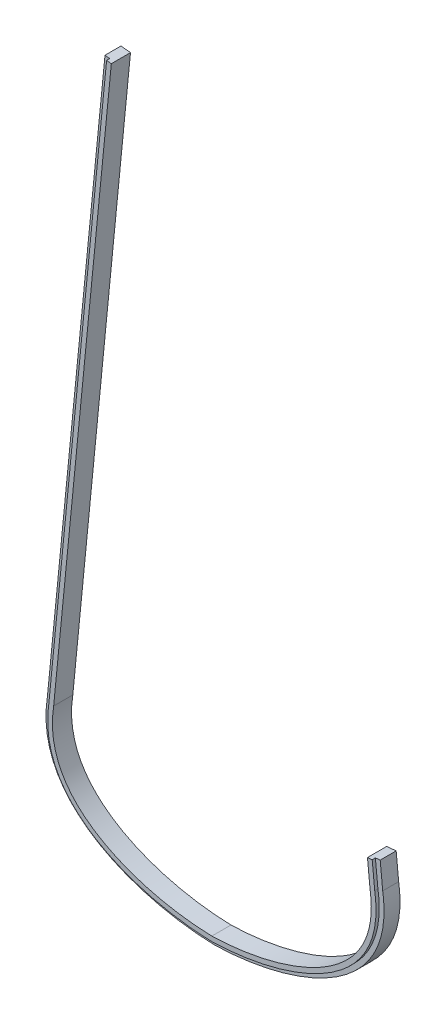
ISO-10303-21;
HEADER;
FILE_DESCRIPTION(('STEP AP214'),'2;1');
FILE_NAME('part.step','',(''),(''),'','','');
FILE_SCHEMA(('AUTOMOTIVE_DESIGN { 1 0 10303 214 1 1 1 1 }'));
ENDSEC;
DATA;
#1=APPLICATION_CONTEXT('core data for automotive mechanical design processes');
#2=APPLICATION_PROTOCOL_DEFINITION('international standard','automotive_design',2000,#1);
#3=PRODUCT_CONTEXT('',#1,'mechanical');
#4=PRODUCT('Part','Part','',(#3));
#5=PRODUCT_RELATED_PRODUCT_CATEGORY('part','',(#4));
#6=PRODUCT_DEFINITION_FORMATION('','',#4);
#7=PRODUCT_DEFINITION_CONTEXT('part definition',#1,'design');
#8=PRODUCT_DEFINITION('design','',#6,#7);
#9=PRODUCT_DEFINITION_SHAPE('','',#8);
#10=(LENGTH_UNIT() NAMED_UNIT(*) SI_UNIT(.MILLI.,.METRE.));
#11=(NAMED_UNIT(*) PLANE_ANGLE_UNIT() SI_UNIT($,.RADIAN.));
#12=(NAMED_UNIT(*) SI_UNIT($,.STERADIAN.) SOLID_ANGLE_UNIT());
#13=UNCERTAINTY_MEASURE_WITH_UNIT(LENGTH_MEASURE(1.E-05),#10,'distance_accuracy_value','');
#14=(GEOMETRIC_REPRESENTATION_CONTEXT(3) GLOBAL_UNCERTAINTY_ASSIGNED_CONTEXT((#13)) GLOBAL_UNIT_ASSIGNED_CONTEXT((#10,
#11,#12)) REPRESENTATION_CONTEXT('',''));
#15=CARTESIAN_POINT('',(0.,0.,0.));
#16=DIRECTION('',(0.,0.,1.));
#17=DIRECTION('',(1.,0.,0.));
#18=AXIS2_PLACEMENT_3D('',#15,#16,#17);
#19=CARTESIAN_POINT('',(0.,0.,19.05));
#20=CARTESIAN_POINT('',(73.6665806217367,1.74067599176395,19.05));
#21=CARTESIAN_POINT('',(181.188092360691,36.2008356091117,19.05));
#22=CARTESIAN_POINT('',(166.6875,130.175,19.05));
#23=B_SPLINE_CURVE_WITH_KNOTS('',3,(#19,#20,#21,#22),.UNSPECIFIED.,.F.,.F.,(4,4),(0.,1.),.UNSPECIFIED.);
#24=DIRECTION('',(0.,0.,-1.));
#25=VECTOR('',#24,1.);
#26=SURFACE_OF_LINEAR_EXTRUSION('',#23,#25);
#27=DIRECTION('',(0.,0.,-1.));
#28=VECTOR('',#27,1.);
#29=CARTESIAN_POINT('',(166.6875,130.175,19.05));
#30=LINE('',#29,#28);
#31=CARTESIAN_POINT('',(166.6875,130.175,15.875));
#32=VERTEX_POINT('',#31);
#33=CARTESIAN_POINT('',(166.6875,130.175,0.));
#34=VERTEX_POINT('',#33);
#35=EDGE_CURVE('E11',#32,#34,#30,.T.);
#36=ORIENTED_EDGE('',*,*,#35,.F.);
#37=CARTESIAN_POINT('',(0.,0.,15.875));
#38=CARTESIAN_POINT('',(73.6665806217367,1.74067599176395,15.875));
#39=CARTESIAN_POINT('',(181.188092360691,36.2008356091117,15.875));
#40=CARTESIAN_POINT('',(166.6875,130.175,15.875));
#41=B_SPLINE_CURVE_WITH_KNOTS('',3,(#37,#38,#39,#40),.UNSPECIFIED.,.F.,.F.,(4,4),(0.,1.),.UNSPECIFIED.);
#42=CARTESIAN_POINT('',(0.,0.,15.875));
#43=VERTEX_POINT('',#42);
#44=EDGE_CURVE('E380',#43,#32,#41,.T.);
#45=ORIENTED_EDGE('',*,*,#44,.F.);
#46=DIRECTION('',(0.,0.,-1.));
#47=VECTOR('',#46,1.);
#48=CARTESIAN_POINT('',(0.,0.,19.05));
#49=LINE('',#48,#47);
#50=CARTESIAN_POINT('',(0.,0.,0.));
#51=VERTEX_POINT('',#50);
#52=EDGE_CURVE('E96',#43,#51,#49,.T.);
#53=ORIENTED_EDGE('',*,*,#52,.T.);
#54=CARTESIAN_POINT('',(0.,0.,0.));
#55=CARTESIAN_POINT('',(73.6665806217367,1.74067599176395,0.));
#56=CARTESIAN_POINT('',(181.188092360691,36.2008356091117,0.));
#57=CARTESIAN_POINT('',(166.6875,130.175,0.));
#58=B_SPLINE_CURVE_WITH_KNOTS('',3,(#54,#55,#56,#57),.UNSPECIFIED.,.F.,.F.,(4,4),(0.,1.),.UNSPECIFIED.);
#59=EDGE_CURVE('E233',#51,#34,#58,.T.);
#60=ORIENTED_EDGE('',*,*,#59,.T.);
#61=EDGE_LOOP('',(#36,#45,#53,#60));
#62=FACE_BOUND('',#61,.T.);
#63=ADVANCED_FACE('F33',(#62),#26,.F.);
#64=CARTESIAN_POINT('',(166.6875,130.175,19.05));
#65=DIRECTION('',(-0.995175000159784,-0.0981158450861778,0.));
#66=DIRECTION('',(0.0981158450861778,-0.995175000159784,0.));
#67=AXIS2_PLACEMENT_3D('',#64,#65,#66);
#68=PLANE('',#67);
#69=DIRECTION('',(0.,0.,-1.));
#70=VECTOR('',#69,1.);
#71=CARTESIAN_POINT('',(164.195357534811,155.452445004058,19.05));
#72=LINE('',#71,#70);
#73=CARTESIAN_POINT('',(164.195357534811,155.452445004058,15.875));
#74=VERTEX_POINT('',#73);
#75=CARTESIAN_POINT('',(164.195357534811,155.452445004058,0.));
#76=VERTEX_POINT('',#75);
#77=EDGE_CURVE('E41',#74,#76,#72,.T.);
#78=ORIENTED_EDGE('',*,*,#77,.F.);
#79=DIRECTION('',(-0.0981158450861778,0.995175000159783,0.));
#80=VECTOR('',#79,1.);
#81=CARTESIAN_POINT('',(166.6875,130.175,15.875));
#82=LINE('',#81,#80);
#83=EDGE_CURVE('E178',#32,#74,#82,.T.);
#84=ORIENTED_EDGE('',*,*,#83,.F.);
#85=ORIENTED_EDGE('',*,*,#35,.T.);
#86=DIRECTION('',(-0.0981158450861778,0.995175000159783,0.));
#87=VECTOR('',#86,1.);
#88=CARTESIAN_POINT('',(166.6875,130.175,0.));
#89=LINE('',#88,#87);
#90=EDGE_CURVE('E181',#34,#76,#89,.T.);
#91=ORIENTED_EDGE('',*,*,#90,.T.);
#92=EDGE_LOOP('',(#78,#84,#85,#91));
#93=FACE_BOUND('',#92,.T.);
#94=ADVANCED_FACE('F165',(#93),#68,.F.);
#95=CARTESIAN_POINT('',(154.716315658289,154.517891579613,19.05));
#96=DIRECTION('',(0.0981158450861753,-0.995175000159784,0.));
#97=DIRECTION('',(0.995175000159784,0.0981158450861754,0.));
#98=AXIS2_PLACEMENT_3D('',#95,#96,#97);
#99=PLANE('',#98);
#100=DIRECTION('',(-0.995175000159784,-0.0981158450861753,0.));
#101=VECTOR('',#100,1.);
#102=CARTESIAN_POINT('',(154.716315658289,154.517891579613,19.05));
#103=LINE('',#102,#101);
#104=CARTESIAN_POINT('',(159.417920429044,154.981430078138,19.05));
#105=VERTEX_POINT('',#104);
#106=CARTESIAN_POINT('',(154.716315658289,154.517891579613,19.05));
#107=VERTEX_POINT('',#106);
#108=EDGE_CURVE('E104',#105,#107,#103,.T.);
#109=ORIENTED_EDGE('',*,*,#108,.F.);
#110=DIRECTION('',(0.,0.,-1.));
#111=VECTOR('',#110,1.);
#112=CARTESIAN_POINT('',(159.417920429044,154.981430078138,1033.20067295574));
#113=LINE('',#112,#111);
#114=CARTESIAN_POINT('',(159.417920429044,154.981430078138,15.875));
#115=VERTEX_POINT('',#114);
#116=EDGE_CURVE('E338',#105,#115,#113,.T.);
#117=ORIENTED_EDGE('',*,*,#116,.T.);
#118=DIRECTION('',(-0.995175000159784,-0.0981158450861753,0.));
#119=VECTOR('',#118,1.);
#120=CARTESIAN_POINT('',(154.716315658289,154.517891579613,15.875));
#121=LINE('',#120,#119);
#122=EDGE_CURVE('E281',#74,#115,#121,.T.);
#123=ORIENTED_EDGE('',*,*,#122,.F.);
#124=ORIENTED_EDGE('',*,*,#77,.T.);
#125=DIRECTION('',(-0.995175000159784,-0.0981158450861753,0.));
#126=VECTOR('',#125,1.);
#127=CARTESIAN_POINT('',(154.716315658289,154.517891579613,0.));
#128=LINE('',#127,#126);
#129=CARTESIAN_POINT('',(154.716315658289,154.517891579613,0.));
#130=VERTEX_POINT('',#129);
#131=EDGE_CURVE('E230',#76,#130,#128,.T.);
#132=ORIENTED_EDGE('',*,*,#131,.T.);
#133=DIRECTION('',(0.,0.,-1.));
#134=VECTOR('',#133,1.);
#135=CARTESIAN_POINT('',(154.716315658289,154.517891579613,19.05));
#136=LINE('',#135,#134);
#137=EDGE_CURVE('E186',#107,#130,#136,.T.);
#138=ORIENTED_EDGE('',*,*,#137,.F.);
#139=EDGE_LOOP('',(#109,#117,#123,#124,#132,#138));
#140=FACE_BOUND('',#139,.T.);
#141=ADVANCED_FACE('F162',(#140),#99,.F.);
#142=CARTESIAN_POINT('',(157.23408188197,128.980548453709,19.05));
#143=DIRECTION('',(0.995175000159784,0.0981158450861758,0.));
#144=DIRECTION('',(-0.0981158450861759,0.995175000159784,0.));
#145=AXIS2_PLACEMENT_3D('',#142,#143,#144);
#146=PLANE('',#145);
#147=DIRECTION('',(0.0981158450861758,-0.995175000159784,0.));
#148=VECTOR('',#147,1.);
#149=CARTESIAN_POINT('',(157.23408188197,128.980548453709,0.));
#150=LINE('',#149,#148);
#151=CARTESIAN_POINT('',(157.23408188197,128.980548453709,0.));
#152=VERTEX_POINT('',#151);
#153=EDGE_CURVE('E225',#130,#152,#150,.T.);
#154=ORIENTED_EDGE('',*,*,#153,.T.);
#155=DIRECTION('',(0.,0.,-1.));
#156=VECTOR('',#155,1.);
#157=CARTESIAN_POINT('',(157.23408188197,128.980548453709,19.05));
#158=LINE('',#157,#156);
#159=CARTESIAN_POINT('',(157.23408188197,128.980548453709,19.05));
#160=VERTEX_POINT('',#159);
#161=EDGE_CURVE('E132',#160,#152,#158,.T.);
#162=ORIENTED_EDGE('',*,*,#161,.F.);
#163=DIRECTION('',(0.0981158450861758,-0.995175000159784,0.));
#164=VECTOR('',#163,1.);
#165=CARTESIAN_POINT('',(157.23408188197,128.980548453709,19.05));
#166=LINE('',#165,#164);
#167=EDGE_CURVE('E120',#107,#160,#166,.T.);
#168=ORIENTED_EDGE('',*,*,#167,.F.);
#169=ORIENTED_EDGE('',*,*,#137,.T.);
#170=EDGE_LOOP('',(#154,#162,#168,#169));
#171=FACE_BOUND('',#170,.T.);
#172=ADVANCED_FACE('F159',(#171),#146,.F.);
#173=CARTESIAN_POINT('',(157.23408188197,128.980548453709,19.05));
#174=CARTESIAN_POINT('',(157.261207353425,128.80475608259,19.05));
#175=CARTESIAN_POINT('',(157.316566229368,128.44670539477,19.05));
#176=CARTESIAN_POINT('',(157.415798732615,127.781927865814,19.05));
#177=CARTESIAN_POINT('',(157.584058118054,126.601085874369,19.05));
#178=CARTESIAN_POINT('',(157.881730698016,124.277278240634,19.05));
#179=CARTESIAN_POINT('',(158.206421640057,121.010360534751,19.05));
#180=CARTESIAN_POINT('',(158.437150465931,117.190167218602,19.05));
#181=CARTESIAN_POINT('',(158.540175043748,112.221426054033,19.05));
#182=CARTESIAN_POINT('',(158.296409220294,106.242287004757,19.05));
#183=CARTESIAN_POINT('',(157.442658539271,99.4182067892226,19.05));
#184=CARTESIAN_POINT('',(156.058613173129,92.923629982478,19.05));
#185=CARTESIAN_POINT('',(153.541361304269,84.6740226733845,19.05));
#186=CARTESIAN_POINT('',(149.192253507085,75.0755375544253,19.05));
#187=CARTESIAN_POINT('',(142.189146148936,64.5645369341676,19.05));
#188=CARTESIAN_POINT('',(130.643933927823,51.8035577227428,19.05));
#189=CARTESIAN_POINT('',(112.436111513656,38.1574524872599,19.05));
#190=CARTESIAN_POINT('',(90.5158541949529,27.6265370641219,19.05));
#191=CARTESIAN_POINT('',(71.6896130592172,21.0508508509878,19.05));
#192=CARTESIAN_POINT('',(57.16523288768,17.0231489798574,19.05));
#193=CARTESIAN_POINT('',(42.4774975697848,13.8758580326201,19.05));
#194=CARTESIAN_POINT('',(30.3032357230849,11.9623162671414,19.05));
#195=CARTESIAN_POINT('',(20.7254590356733,10.8404413717739,19.05));
#196=CARTESIAN_POINT('',(13.6522104162235,10.1989584372761,19.05));
#197=CARTESIAN_POINT('',(7.88003948147285,9.82720773209708,19.05));
#198=CARTESIAN_POINT('',(3.34047289736703,9.62475505591648,19.05));
#199=CARTESIAN_POINT('',(1.11761160220118,9.55519319222505,19.05));
#200=CARTESIAN_POINT('',(0.,9.52776173986118,19.05));
#201=B_SPLINE_CURVE_WITH_KNOTS('',3,(#173,#174,#175,#176,#177,#178,#179,#180,#181,#182,#183,
#184,#185,#186,#187,#188,#189,#190,#191,#192,#193,#194,#195,#196,#197,#198,#199,#200),
.UNSPECIFIED.,.F.,.F.,(4,1,1,1,1,1,1,1,1,1,1,1,1,1,1,1,1,1,1,1,1,1,1,1,1,4),
(0.00105703595463424,0.00300988454184536,0.00496273312905637,0.0088684303034785,
0.0166798246523227,0.0323026133500111,0.0479254020476996,0.063548190745388,0.0947937681407649,
0.126039345536142,0.157284922931519,0.188530500326895,0.251021655117649,0.313512809908403,
0.376003964699156,0.500986274280664,0.625968583862171,0.688459738652925,0.750950893443679,
0.813442048234432,0.875933203025186,0.907178780420563,0.93842435781594,0.969669935211317,
0.985292723909005,1.00091551260669),.UNSPECIFIED.);
#202=DIRECTION('',(0.,0.,-1.));
#203=VECTOR('',#202,1.);
#204=SURFACE_OF_LINEAR_EXTRUSION('',#201,#203);
#205=CARTESIAN_POINT('',(157.23408188197,128.980548453709,0.));
#206=CARTESIAN_POINT('',(157.261207353425,128.80475608259,0.));
#207=CARTESIAN_POINT('',(157.316566229368,128.44670539477,0.));
#208=CARTESIAN_POINT('',(157.415798732615,127.781927865814,0.));
#209=CARTESIAN_POINT('',(157.584058118054,126.601085874369,0.));
#210=CARTESIAN_POINT('',(157.881730698016,124.277278240634,0.));
#211=CARTESIAN_POINT('',(158.206421640057,121.010360534751,0.));
#212=CARTESIAN_POINT('',(158.437150465931,117.190167218602,0.));
#213=CARTESIAN_POINT('',(158.540175043748,112.221426054033,0.));
#214=CARTESIAN_POINT('',(158.296409220294,106.242287004757,0.));
#215=CARTESIAN_POINT('',(157.442658539271,99.4182067892226,0.));
#216=CARTESIAN_POINT('',(156.058613173129,92.923629982478,0.));
#217=CARTESIAN_POINT('',(153.541361304269,84.6740226733845,0.));
#218=CARTESIAN_POINT('',(149.192253507085,75.0755375544253,0.));
#219=CARTESIAN_POINT('',(142.189146148936,64.5645369341676,0.));
#220=CARTESIAN_POINT('',(130.643933927823,51.8035577227428,0.));
#221=CARTESIAN_POINT('',(112.436111513656,38.1574524872599,0.));
#222=CARTESIAN_POINT('',(90.5158541949529,27.6265370641219,0.));
#223=CARTESIAN_POINT('',(71.6896130592172,21.0508508509878,0.));
#224=CARTESIAN_POINT('',(57.16523288768,17.0231489798574,0.));
#225=CARTESIAN_POINT('',(42.4774975697848,13.8758580326201,0.));
#226=CARTESIAN_POINT('',(30.3032357230849,11.9623162671414,0.));
#227=CARTESIAN_POINT('',(20.7254590356733,10.8404413717739,0.));
#228=CARTESIAN_POINT('',(13.6522104162235,10.1989584372761,0.));
#229=CARTESIAN_POINT('',(7.88003948147285,9.82720773209708,0.));
#230=CARTESIAN_POINT('',(3.34047289736703,9.62475505591648,0.));
#231=CARTESIAN_POINT('',(1.11761160220118,9.55519319222505,0.));
#232=CARTESIAN_POINT('',(0.,9.52776173986118,0.));
#233=B_SPLINE_CURVE_WITH_KNOTS('',3,(#205,#206,#207,#208,#209,#210,#211,#212,#213,#214,#215,
#216,#217,#218,#219,#220,#221,#222,#223,#224,#225,#226,#227,#228,#229,#230,#231,#232),
.UNSPECIFIED.,.F.,.F.,(4,1,1,1,1,1,1,1,1,1,1,1,1,1,1,1,1,1,1,1,1,1,1,1,1,4),
(0.00105703595463424,0.00300988454184536,0.00496273312905637,0.0088684303034785,
0.0166798246523227,0.0323026133500111,0.0479254020476996,0.063548190745388,0.0947937681407649,
0.126039345536142,0.157284922931519,0.188530500326895,0.251021655117649,0.313512809908403,
0.376003964699156,0.500986274280664,0.625968583862171,0.688459738652925,0.750950893443679,
0.813442048234432,0.875933203025186,0.907178780420563,0.93842435781594,0.969669935211317,
0.985292723909005,1.00091551260669),.UNSPECIFIED.);
#234=CARTESIAN_POINT('',(0.,9.52776173986118,0.));
#235=VERTEX_POINT('',#234);
#236=EDGE_CURVE('E129',#152,#235,#233,.T.);
#237=ORIENTED_EDGE('',*,*,#236,.T.);
#238=DIRECTION('',(0.,0.,-1.));
#239=VECTOR('',#238,1.);
#240=CARTESIAN_POINT('',(0.,9.52776173986118,19.05));
#241=LINE('',#240,#239);
#242=CARTESIAN_POINT('',(0.,9.52776173986118,19.05));
#243=VERTEX_POINT('',#242);
#244=EDGE_CURVE('E126',#243,#235,#241,.T.);
#245=ORIENTED_EDGE('',*,*,#244,.F.);
#246=EDGE_CURVE('E112',#160,#243,#201,.T.);
#247=ORIENTED_EDGE('',*,*,#246,.F.);
#248=ORIENTED_EDGE('',*,*,#161,.T.);
#249=EDGE_LOOP('',(#237,#245,#247,#248));
#250=FACE_BOUND('',#249,.T.);
#251=ADVANCED_FACE('F127',(#250),#204,.F.);
#252=CARTESIAN_POINT('',(0.,9.52776173986118,19.05));
#253=CARTESIAN_POINT('',(-1.11761160220116,9.55519319222505,19.05));
#254=CARTESIAN_POINT('',(-3.34047289736702,9.62475505591649,19.05));
#255=CARTESIAN_POINT('',(-7.88003948147277,9.82720773209708,19.05));
#256=CARTESIAN_POINT('',(-13.6522104162235,10.1989584372761,19.05));
#257=CARTESIAN_POINT('',(-20.7254590356733,10.8404413717739,19.05));
#258=CARTESIAN_POINT('',(-30.303235723085,11.9623162671414,19.05));
#259=CARTESIAN_POINT('',(-42.4774975697847,13.8758580326201,19.05));
#260=CARTESIAN_POINT('',(-57.16523288768,17.0231489798574,19.05));
#261=CARTESIAN_POINT('',(-71.6896130592172,21.0508508509878,19.05));
#262=CARTESIAN_POINT('',(-90.5158541949528,27.6265370641219,19.05));
#263=CARTESIAN_POINT('',(-112.436111513656,38.1574524872599,19.05));
#264=CARTESIAN_POINT('',(-130.643933927824,51.8035577227429,19.05));
#265=CARTESIAN_POINT('',(-142.189146148936,64.5645369341677,19.05));
#266=CARTESIAN_POINT('',(-149.192253507085,75.0755375544254,19.05));
#267=CARTESIAN_POINT('',(-153.541361304269,84.6740226733847,19.05));
#268=CARTESIAN_POINT('',(-156.058613173129,92.9236299824781,19.05));
#269=CARTESIAN_POINT('',(-157.442658539271,99.4182067892228,19.05));
#270=CARTESIAN_POINT('',(-158.296409220294,106.242287004757,19.05));
#271=CARTESIAN_POINT('',(-158.540175043748,112.221426054033,19.05));
#272=CARTESIAN_POINT('',(-158.437150465931,117.190167218602,19.05));
#273=CARTESIAN_POINT('',(-158.206421640056,121.010360534751,19.05));
#274=CARTESIAN_POINT('',(-157.881730698017,124.277278240634,19.05));
#275=CARTESIAN_POINT('',(-157.584058118053,126.601085874369,19.05));
#276=CARTESIAN_POINT('',(-157.415798732615,127.781927865814,19.05));
#277=CARTESIAN_POINT('',(-157.316566229367,128.44670539477,19.05));
#278=CARTESIAN_POINT('',(-157.261207353425,128.80475608259,19.05));
#279=CARTESIAN_POINT('',(-157.23408188197,128.980548453709,19.05));
#280=B_SPLINE_CURVE_WITH_KNOTS('',3,(#252,#253,#254,#255,#256,#257,#258,#259,#260,#261,#262,
#263,#264,#265,#266,#267,#268,#269,#270,#271,#272,#273,#274,#275,#276,#277,#278,#279),
.UNSPECIFIED.,.F.,.F.,(4,1,1,1,1,1,1,1,1,1,1,1,1,1,1,1,1,1,1,1,1,1,1,1,1,4),
(0.00105703595463399,0.0166798246523224,0.0323026133500109,0.0635481907453877,
0.0947937681407646,0.126039345536141,0.188530500326895,0.251021655117649,0.313512809908403,
0.376003964699157,0.500986274280664,0.625968583862172,0.688459738652925,0.750950893443679,
0.813442048234433,0.84468762562981,0.875933203025187,0.907178780420563,0.93842435781594,
0.954047146513629,0.969669935211317,0.985292723909006,0.99310411825785,0.997009815432272,
0.998962664019483,1.00091551260669),.UNSPECIFIED.);
#281=DIRECTION('',(0.,0.,-1.));
#282=VECTOR('',#281,1.);
#283=SURFACE_OF_LINEAR_EXTRUSION('',#280,#282);
#284=CARTESIAN_POINT('',(0.,9.52776173986118,0.));
#285=CARTESIAN_POINT('',(-1.11761160220116,9.55519319222505,0.));
#286=CARTESIAN_POINT('',(-3.34047289736702,9.62475505591649,0.));
#287=CARTESIAN_POINT('',(-7.88003948147277,9.82720773209708,0.));
#288=CARTESIAN_POINT('',(-13.6522104162235,10.1989584372761,0.));
#289=CARTESIAN_POINT('',(-20.7254590356733,10.8404413717739,0.));
#290=CARTESIAN_POINT('',(-30.303235723085,11.9623162671414,0.));
#291=CARTESIAN_POINT('',(-42.4774975697847,13.8758580326201,0.));
#292=CARTESIAN_POINT('',(-57.16523288768,17.0231489798574,0.));
#293=CARTESIAN_POINT('',(-71.6896130592172,21.0508508509878,0.));
#294=CARTESIAN_POINT('',(-90.5158541949528,27.6265370641219,0.));
#295=CARTESIAN_POINT('',(-112.436111513656,38.1574524872599,0.));
#296=CARTESIAN_POINT('',(-130.643933927824,51.8035577227429,0.));
#297=CARTESIAN_POINT('',(-142.189146148936,64.5645369341677,0.));
#298=CARTESIAN_POINT('',(-149.192253507085,75.0755375544254,0.));
#299=CARTESIAN_POINT('',(-153.541361304269,84.6740226733847,0.));
#300=CARTESIAN_POINT('',(-156.058613173129,92.9236299824781,0.));
#301=CARTESIAN_POINT('',(-157.442658539271,99.4182067892228,0.));
#302=CARTESIAN_POINT('',(-158.296409220294,106.242287004757,0.));
#303=CARTESIAN_POINT('',(-158.540175043748,112.221426054033,0.));
#304=CARTESIAN_POINT('',(-158.437150465931,117.190167218602,0.));
#305=CARTESIAN_POINT('',(-158.206421640056,121.010360534751,0.));
#306=CARTESIAN_POINT('',(-157.881730698017,124.277278240634,0.));
#307=CARTESIAN_POINT('',(-157.584058118053,126.601085874369,0.));
#308=CARTESIAN_POINT('',(-157.415798732615,127.781927865814,0.));
#309=CARTESIAN_POINT('',(-157.316566229367,128.44670539477,0.));
#310=CARTESIAN_POINT('',(-157.261207353425,128.80475608259,0.));
#311=CARTESIAN_POINT('',(-157.23408188197,128.980548453709,0.));
#312=B_SPLINE_CURVE_WITH_KNOTS('',3,(#284,#285,#286,#287,#288,#289,#290,#291,#292,#293,#294,
#295,#296,#297,#298,#299,#300,#301,#302,#303,#304,#305,#306,#307,#308,#309,#310,#311),
.UNSPECIFIED.,.F.,.F.,(4,1,1,1,1,1,1,1,1,1,1,1,1,1,1,1,1,1,1,1,1,1,1,1,1,4),
(0.00105703595463399,0.0166798246523224,0.0323026133500109,0.0635481907453877,
0.0947937681407646,0.126039345536141,0.188530500326895,0.251021655117649,0.313512809908403,
0.376003964699157,0.500986274280664,0.625968583862172,0.688459738652925,0.750950893443679,
0.813442048234433,0.84468762562981,0.875933203025187,0.907178780420563,0.93842435781594,
0.954047146513629,0.969669935211317,0.985292723909006,0.99310411825785,0.997009815432272,
0.998962664019483,1.00091551260669),.UNSPECIFIED.);
#313=CARTESIAN_POINT('',(-157.23408188197,128.980548453709,0.));
#314=VERTEX_POINT('',#313);
#315=EDGE_CURVE('E215',#235,#314,#312,.T.);
#316=ORIENTED_EDGE('',*,*,#315,.T.);
#317=DIRECTION('',(0.,0.,-1.));
#318=VECTOR('',#317,1.);
#319=CARTESIAN_POINT('',(-157.23408188197,128.980548453709,19.05));
#320=LINE('',#319,#318);
#321=CARTESIAN_POINT('',(-157.23408188197,128.980548453709,19.05));
#322=VERTEX_POINT('',#321);
#323=EDGE_CURVE('E133',#322,#314,#320,.T.);
#324=ORIENTED_EDGE('',*,*,#323,.F.);
#325=EDGE_CURVE('E117',#243,#322,#280,.T.);
#326=ORIENTED_EDGE('',*,*,#325,.F.);
#327=ORIENTED_EDGE('',*,*,#244,.T.);
#328=EDGE_LOOP('',(#316,#324,#326,#327));
#329=FACE_BOUND('',#328,.T.);
#330=ADVANCED_FACE('F135',(#329),#283,.F.);
#331=CARTESIAN_POINT('',(-157.23408188197,128.980548453709,19.05));
#332=DIRECTION('',(-0.995175000159784,0.0981158450861758,0.));
#333=DIRECTION('',(-0.0981158450861758,-0.995175000159784,0.));
#334=AXIS2_PLACEMENT_3D('',#331,#332,#333);
#335=PLANE('',#334);
#336=DIRECTION('',(0.0981158450861758,0.995175000159784,0.));
#337=VECTOR('',#336,1.);
#338=CARTESIAN_POINT('',(-157.23408188197,128.980548453709,0.));
#339=LINE('',#338,#337);
#340=CARTESIAN_POINT('',(-99.8891814241341,710.6216816689,0.));
#341=VERTEX_POINT('',#340);
#342=EDGE_CURVE('E213',#314,#341,#339,.T.);
#343=ORIENTED_EDGE('',*,*,#342,.T.);
#344=DIRECTION('',(0.,0.,-1.));
#345=VECTOR('',#344,1.);
#346=CARTESIAN_POINT('',(-99.8891814241341,710.6216816689,19.05));
#347=LINE('',#346,#345);
#348=CARTESIAN_POINT('',(-99.8891814241341,710.6216816689,19.05));
#349=VERTEX_POINT('',#348);
#350=EDGE_CURVE('E192',#349,#341,#347,.T.);
#351=ORIENTED_EDGE('',*,*,#350,.F.);
#352=DIRECTION('',(0.0981158450861758,0.995175000159784,0.));
#353=VECTOR('',#352,1.);
#354=CARTESIAN_POINT('',(-157.23408188197,128.980548453709,19.05));
#355=LINE('',#354,#353);
#356=EDGE_CURVE('E57',#322,#349,#355,.T.);
#357=ORIENTED_EDGE('',*,*,#356,.F.);
#358=ORIENTED_EDGE('',*,*,#323,.T.);
#359=EDGE_LOOP('',(#343,#351,#357,#358));
#360=FACE_BOUND('',#359,.T.);
#361=ADVANCED_FACE('F155',(#360),#335,.F.);
#362=CARTESIAN_POINT('',(-109.368223300656,711.556235093346,19.05));
#363=DIRECTION('',(-0.0981158450861748,-0.995175000159784,0.));
#364=DIRECTION('',(0.995175000159784,-0.0981158450861748,0.));
#365=AXIS2_PLACEMENT_3D('',#362,#363,#364);
#366=PLANE('',#365);
#367=DIRECTION('',(-0.995175000159784,0.0981158450861748,0.));
#368=VECTOR('',#367,1.);
#369=CARTESIAN_POINT('',(-109.368223300656,711.556235093346,15.875));
#370=LINE('',#369,#368);
#371=CARTESIAN_POINT('',(-104.590786194889,711.085220167425,15.875));
#372=VERTEX_POINT('',#371);
#373=CARTESIAN_POINT('',(-109.368223300656,711.556235093346,15.875));
#374=VERTEX_POINT('',#373);
#375=EDGE_CURVE('E269',#372,#374,#370,.T.);
#376=ORIENTED_EDGE('',*,*,#375,.F.);
#377=DIRECTION('',(0.,0.,-1.));
#378=VECTOR('',#377,1.);
#379=CARTESIAN_POINT('',(-104.590786194889,711.085220167425,1033.20067295574));
#380=LINE('',#379,#378);
#381=CARTESIAN_POINT('',(-104.590786194889,711.085220167425,19.05));
#382=VERTEX_POINT('',#381);
#383=EDGE_CURVE('E273',#382,#372,#380,.T.);
#384=ORIENTED_EDGE('',*,*,#383,.F.);
#385=DIRECTION('',(-0.995175000159784,0.0981158450861748,0.));
#386=VECTOR('',#385,1.);
#387=CARTESIAN_POINT('',(-109.368223300656,711.556235093346,19.05));
#388=LINE('',#387,#386);
#389=EDGE_CURVE('E138',#349,#382,#388,.T.);
#390=ORIENTED_EDGE('',*,*,#389,.F.);
#391=ORIENTED_EDGE('',*,*,#350,.T.);
#392=DIRECTION('',(-0.995175000159784,0.0981158450861748,0.));
#393=VECTOR('',#392,1.);
#394=CARTESIAN_POINT('',(-109.368223300656,711.556235093346,0.));
#395=LINE('',#394,#393);
#396=CARTESIAN_POINT('',(-109.368223300656,711.556235093346,0.));
#397=VERTEX_POINT('',#396);
#398=EDGE_CURVE('E210',#341,#397,#395,.T.);
#399=ORIENTED_EDGE('',*,*,#398,.T.);
#400=DIRECTION('',(0.,0.,-1.));
#401=VECTOR('',#400,1.);
#402=CARTESIAN_POINT('',(-109.368223300656,711.556235093346,19.05));
#403=LINE('',#402,#401);
#404=EDGE_CURVE('E195',#374,#397,#403,.T.);
#405=ORIENTED_EDGE('',*,*,#404,.F.);
#406=EDGE_LOOP('',(#376,#384,#390,#391,#399,#405));
#407=FACE_BOUND('',#406,.T.);
#408=ADVANCED_FACE('F257',(#407),#366,.F.);
#409=CARTESIAN_POINT('',(-166.6875,130.175,19.05));
#410=DIRECTION('',(0.995175000159784,-0.0981158450861758,0.));
#411=DIRECTION('',(0.0981158450861759,0.995175000159784,0.));
#412=AXIS2_PLACEMENT_3D('',#409,#410,#411);
#413=PLANE('',#412);
#414=DIRECTION('',(0.,0.,-1.));
#415=VECTOR('',#414,1.);
#416=CARTESIAN_POINT('',(-166.6875,130.175,19.05));
#417=LINE('',#416,#415);
#418=CARTESIAN_POINT('',(-166.6875,130.175,15.875));
#419=VERTEX_POINT('',#418);
#420=CARTESIAN_POINT('',(-166.6875,130.175,0.));
#421=VERTEX_POINT('',#420);
#422=EDGE_CURVE('E197',#419,#421,#417,.T.);
#423=ORIENTED_EDGE('',*,*,#422,.F.);
#424=DIRECTION('',(-0.0981158450861758,-0.995175000159784,0.));
#425=VECTOR('',#424,1.);
#426=CARTESIAN_POINT('',(-166.6875,130.175,15.875));
#427=LINE('',#426,#425);
#428=EDGE_CURVE('E280',#374,#419,#427,.T.);
#429=ORIENTED_EDGE('',*,*,#428,.F.);
#430=ORIENTED_EDGE('',*,*,#404,.T.);
#431=DIRECTION('',(-0.0981158450861758,-0.995175000159784,0.));
#432=VECTOR('',#431,1.);
#433=CARTESIAN_POINT('',(-166.6875,130.175,0.));
#434=LINE('',#433,#432);
#435=EDGE_CURVE('E204',#397,#421,#434,.T.);
#436=ORIENTED_EDGE('',*,*,#435,.T.);
#437=EDGE_LOOP('',(#423,#429,#430,#436));
#438=FACE_BOUND('',#437,.T.);
#439=ADVANCED_FACE('F252',(#438),#413,.F.);
#440=CARTESIAN_POINT('',(-166.6875,130.175,19.05));
#441=CARTESIAN_POINT('',(-181.188092360691,36.2008356091117,19.05));
#442=CARTESIAN_POINT('',(-73.6665806217367,1.74067599176395,19.05));
#443=CARTESIAN_POINT('',(0.,0.,19.05));
#444=B_SPLINE_CURVE_WITH_KNOTS('',3,(#440,#441,#442,#443),.UNSPECIFIED.,.F.,.F.,(4,4),(0.,1.),.UNSPECIFIED.);
#445=DIRECTION('',(0.,0.,-1.));
#446=VECTOR('',#445,1.);
#447=SURFACE_OF_LINEAR_EXTRUSION('',#444,#446);
#448=ORIENTED_EDGE('',*,*,#52,.F.);
#449=CARTESIAN_POINT('',(-166.6875,130.175,15.875));
#450=CARTESIAN_POINT('',(-181.188092360691,36.2008356091117,15.875));
#451=CARTESIAN_POINT('',(-73.6665806217367,1.74067599176395,15.875));
#452=CARTESIAN_POINT('',(0.,0.,15.875));
#453=B_SPLINE_CURVE_WITH_KNOTS('',3,(#449,#450,#451,#452),.UNSPECIFIED.,.F.,.F.,(4,4),(0.,1.),.UNSPECIFIED.);
#454=EDGE_CURVE('E283',#419,#43,#453,.T.);
#455=ORIENTED_EDGE('',*,*,#454,.F.);
#456=ORIENTED_EDGE('',*,*,#422,.T.);
#457=CARTESIAN_POINT('',(-166.6875,130.175,0.));
#458=CARTESIAN_POINT('',(-181.188092360691,36.2008356091117,0.));
#459=CARTESIAN_POINT('',(-73.6665806217367,1.74067599176395,0.));
#460=CARTESIAN_POINT('',(0.,0.,0.));
#461=B_SPLINE_CURVE_WITH_KNOTS('',3,(#457,#458,#459,#460),.UNSPECIFIED.,.F.,.F.,(4,4),(0.,1.),.UNSPECIFIED.);
#462=EDGE_CURVE('E200',#421,#51,#461,.T.);
#463=ORIENTED_EDGE('',*,*,#462,.T.);
#464=EDGE_LOOP('',(#448,#455,#456,#463));
#465=FACE_BOUND('',#464,.T.);
#466=ADVANCED_FACE('F248',(#465),#447,.F.);
#467=CARTESIAN_POINT('',(116.406439868411,30.4999418503284,19.05));
#468=DIRECTION('',(0.,0.,-1.));
#469=DIRECTION('',(-1.,0.,0.));
#470=AXIS2_PLACEMENT_3D('',#467,#468,#469);
#471=PLANE('',#470);
#472=CARTESIAN_POINT('',(0.,4.8019656733568,19.05));
#473=CARTESIAN_POINT('',(9.03907698626883,5.01964561487191,19.05));
#474=CARTESIAN_POINT('',(18.6153433567643,5.74008708261957,19.05));
#475=CARTESIAN_POINT('',(38.2065514943315,8.29042097696362,19.05));
#476=CARTESIAN_POINT('',(48.2218031021322,10.1203021708703,19.05));
#477=CARTESIAN_POINT('',(68.0631267943314,14.9833156605444,19.05));
#478=CARTESIAN_POINT('',(77.8891698217527,18.0166658385847,19.05));
#479=CARTESIAN_POINT('',(96.7266048457598,25.3674129985161,19.05));
#480=CARTESIAN_POINT('',(105.737388343201,29.6850394126262,19.05));
#481=CARTESIAN_POINT('',(122.329339782085,39.6641605862023,19.05));
#482=CARTESIAN_POINT('',(129.908900724733,45.3246958441402,19.05));
#483=CARTESIAN_POINT('',(139.777007015638,54.8557777853729,19.05));
#484=CARTESIAN_POINT('',(142.81672845937,58.2061108873266,19.05));
#485=CARTESIAN_POINT('',(148.333510848089,65.2630427955149,19.05));
#486=CARTESIAN_POINT('',(150.810694166329,68.9694948344997,19.05));
#487=CARTESIAN_POINT('',(155.14310919834,76.7562862040459,19.05));
#488=CARTESIAN_POINT('',(156.998589935454,80.8366290289817,19.05));
#489=CARTESIAN_POINT('',(160.026646994464,89.3998674782922,19.05));
#490=CARTESIAN_POINT('',(161.19941559066,93.8830050772727,19.05));
#491=CARTESIAN_POINT('',(162.791963270438,103.287974059396,19.05));
#492=CARTESIAN_POINT('',(163.211691294434,108.210111051376,19.05));
#493=CARTESIAN_POINT('',(163.215151327399,115.948212653987,19.05));
#494=CARTESIAN_POINT('',(163.111865799183,118.586683422783,19.05));
#495=CARTESIAN_POINT('',(162.792061754453,122.635654516622,19.05));
#496=CARTESIAN_POINT('',(162.657978395405,124.000517644224,19.05));
#497=CARTESIAN_POINT('',(162.414585491859,126.070904338603,19.05));
#498=CARTESIAN_POINT('',(162.282321944954,127.111870229923,19.05));
#499=CARTESIAN_POINT('',(162.109292482056,128.336489493244,19.05));
#500=CARTESIAN_POINT('',(162.031100506215,128.863509080031,19.05));
#501=CARTESIAN_POINT('',(161.978072786777,129.215341167694,19.05));
#502=CARTESIAN_POINT('',(161.951296998446,129.38946440418,19.05));
#503=CARTESIAN_POINT('',(161.922977268513,129.572996420669,19.05));
#504=B_SPLINE_CURVE_WITH_KNOTS('',3,(#472,#473,#474,#475,#476,#477,#478,#479,#480,#481,#482,
#483,#484,#485,#486,#487,#488,#489,#490,#491,#492,#493,#494,#495,#496,#497,#498,#499,#500,#501,
#502,#503),.UNSPECIFIED.,.F.,.F.,(4,2,2,2,2,2,2,2,2,2,2,2,2,1,1,2,4),(0.,0.125,0.25,0.375,0.5,
0.625,0.6875,0.75,0.8125,0.875,0.9375,0.96875,0.984375,0.9921875,0.99609375,0.998046875,1.),.UNSPECIFIED.);
#505=CARTESIAN_POINT('',(161.922977268513,129.572996420669,19.05));
#506=VERTEX_POINT('',#505);
#507=CARTESIAN_POINT('',(0.,4.8019656733568,19.05));
#508=VERTEX_POINT('',#507);
#509=EDGE_CURVE('E306',#506,#508,#504,.F.);
#510=ORIENTED_EDGE('',*,*,#509,.F.);
#511=DIRECTION('',(0.0981158450861776,-0.995175000159784,0.));
#512=VECTOR('',#511,1.);
#513=CARTESIAN_POINT('',(161.922977268513,129.572996420669,19.05));
#514=LINE('',#513,#512);
#515=EDGE_CURVE('E292',#105,#506,#514,.T.);
#516=ORIENTED_EDGE('',*,*,#515,.F.);
#517=ORIENTED_EDGE('',*,*,#108,.T.);
#518=ORIENTED_EDGE('',*,*,#167,.T.);
#519=ORIENTED_EDGE('',*,*,#246,.T.);
#520=ORIENTED_EDGE('',*,*,#325,.T.);
#521=ORIENTED_EDGE('',*,*,#356,.T.);
#522=ORIENTED_EDGE('',*,*,#389,.T.);
#523=DIRECTION('',(0.0981158450861758,0.995175000159784,0.));
#524=VECTOR('',#523,1.);
#525=CARTESIAN_POINT('',(-104.590786194889,711.085220167425,19.05));
#526=LINE('',#525,#524);
#527=CARTESIAN_POINT('',(-161.922977268513,129.57299642067,19.05));
#528=VERTEX_POINT('',#527);
#529=EDGE_CURVE('E328',#528,#382,#526,.T.);
#530=ORIENTED_EDGE('',*,*,#529,.F.);
#531=CARTESIAN_POINT('',(-161.922977268513,129.57299642067,19.05));
#532=CARTESIAN_POINT('',(-161.951296998446,129.389464404181,19.05));
#533=CARTESIAN_POINT('',(-161.978072786777,129.215341167694,19.05));
#534=CARTESIAN_POINT('',(-162.031100506215,128.863509080031,19.05));
#535=CARTESIAN_POINT('',(-162.109292482056,128.336489493244,19.05));
#536=CARTESIAN_POINT('',(-162.282321944954,127.111870229924,19.05));
#537=CARTESIAN_POINT('',(-162.590936715881,124.682949208025,19.05));
#538=CARTESIAN_POINT('',(-162.792061754453,122.635654516623,19.05));
#539=CARTESIAN_POINT('',(-163.111865799183,118.586683422784,19.05));
#540=CARTESIAN_POINT('',(-163.215151327399,115.948212653988,19.05));
#541=CARTESIAN_POINT('',(-163.211691294434,108.210111051377,19.05));
#542=CARTESIAN_POINT('',(-162.791963270438,103.287974059397,19.05));
#543=CARTESIAN_POINT('',(-161.19941559066,93.883005077273,19.05));
#544=CARTESIAN_POINT('',(-160.026646994464,89.3998674782925,19.05));
#545=CARTESIAN_POINT('',(-156.998589935454,80.8366290289819,19.05));
#546=CARTESIAN_POINT('',(-155.14310919834,76.7562862040461,19.05));
#547=CARTESIAN_POINT('',(-150.810694166329,68.9694948344999,19.05));
#548=CARTESIAN_POINT('',(-148.33351084809,65.2630427955151,19.05));
#549=CARTESIAN_POINT('',(-142.816728459371,58.2061108873267,19.05));
#550=CARTESIAN_POINT('',(-139.777007015638,54.8557777853731,19.05));
#551=CARTESIAN_POINT('',(-129.908900724734,45.3246958441403,19.05));
#552=CARTESIAN_POINT('',(-122.329339782085,39.6641605862024,19.05));
#553=CARTESIAN_POINT('',(-105.737388343201,29.6850394126263,19.05));
#554=CARTESIAN_POINT('',(-96.7266048457599,25.3674129985162,19.05));
#555=CARTESIAN_POINT('',(-77.8891698217528,18.0166658385847,19.05));
#556=CARTESIAN_POINT('',(-68.0631267943315,14.9833156605444,19.05));
#557=CARTESIAN_POINT('',(-48.2218031021323,10.1203021708703,19.05));
#558=CARTESIAN_POINT('',(-38.2065514943316,8.29042097696363,19.05));
#559=CARTESIAN_POINT('',(-18.6153433567644,5.74008708261957,19.05));
#560=CARTESIAN_POINT('',(-9.03907698626884,5.01964561487191,19.05));
#561=CARTESIAN_POINT('',(0.,4.8019656733568,19.05));
#562=B_SPLINE_CURVE_WITH_KNOTS('',3,(#531,#532,#533,#534,#535,#536,#537,#538,#539,#540,#541,
#542,#543,#544,#545,#546,#547,#548,#549,#550,#551,#552,#553,#554,#555,#556,#557,#558,#559,#560,
#561),.UNSPECIFIED.,.F.,.F.,(4,2,1,1,1,2,2,2,2,2,2,2,2,2,2,2,4),(0.,0.00195312499999992,
0.00390624999999983,0.00781249999999967,0.0156249999999997,0.0312499999999997,
0.0624999999999997,0.125,0.1875,0.25,0.3125,0.375,0.5,0.625,0.75,0.875,1.),.UNSPECIFIED.);
#563=EDGE_CURVE('E48',#508,#528,#562,.F.);
#564=ORIENTED_EDGE('',*,*,#563,.F.);
#565=EDGE_LOOP('',(#510,#516,#517,#518,#519,#520,#521,#522,#530,#564));
#566=FACE_BOUND('',#565,.T.);
#567=ADVANCED_FACE('F115',(#566),#471,.F.);
#568=CARTESIAN_POINT('',(116.406439868411,30.4999418503284,0.));
#569=DIRECTION('',(0.,0.,-1.));
#570=DIRECTION('',(-1.,0.,0.));
#571=AXIS2_PLACEMENT_3D('',#568,#569,#570);
#572=PLANE('',#571);
#573=ORIENTED_EDGE('',*,*,#59,.F.);
#574=ORIENTED_EDGE('',*,*,#462,.F.);
#575=ORIENTED_EDGE('',*,*,#435,.F.);
#576=ORIENTED_EDGE('',*,*,#398,.F.);
#577=ORIENTED_EDGE('',*,*,#342,.F.);
#578=ORIENTED_EDGE('',*,*,#315,.F.);
#579=ORIENTED_EDGE('',*,*,#236,.F.);
#580=ORIENTED_EDGE('',*,*,#153,.F.);
#581=ORIENTED_EDGE('',*,*,#131,.F.);
#582=ORIENTED_EDGE('',*,*,#90,.F.);
#583=EDGE_LOOP('',(#573,#574,#575,#576,#577,#578,#579,#580,#581,#582));
#584=FACE_BOUND('',#583,.T.);
#585=ADVANCED_FACE('F254',(#584),#572,.T.);
#586=CARTESIAN_POINT('',(161.922977268513,129.572996420669,1033.20067295574));
#587=DIRECTION('',(-0.995175000159784,-0.0981158450861776,0.));
#588=DIRECTION('',(0.0981158450861776,-0.995175000159784,0.));
#589=AXIS2_PLACEMENT_3D('',#586,#587,#588);
#590=PLANE('',#589);
#591=ORIENTED_EDGE('',*,*,#515,.T.);
#592=DIRECTION('',(0.,0.,-1.));
#593=VECTOR('',#592,1.);
#594=CARTESIAN_POINT('',(161.922977268513,129.572996420669,1033.20067295574));
#595=LINE('',#594,#593);
#596=CARTESIAN_POINT('',(161.922977268513,129.572996420669,15.8750000000002));
#597=VERTEX_POINT('',#596);
#598=EDGE_CURVE('E237',#506,#597,#595,.T.);
#599=ORIENTED_EDGE('',*,*,#598,.T.);
#600=DIRECTION('',(0.0981158450861776,-0.995175000159784,0.));
#601=VECTOR('',#600,1.);
#602=CARTESIAN_POINT('',(161.922977268513,129.572996420669,15.8750000000001));
#603=LINE('',#602,#601);
#604=EDGE_CURVE('E337',#115,#597,#603,.T.);
#605=ORIENTED_EDGE('',*,*,#604,.F.);
#606=ORIENTED_EDGE('',*,*,#116,.F.);
#607=EDGE_LOOP('',(#591,#599,#605,#606));
#608=FACE_BOUND('',#607,.T.);
#609=ADVANCED_FACE('F362',(#608),#590,.F.);
#610=CARTESIAN_POINT('',(0.,4.8019656733568,1033.20067295574));
#611=CARTESIAN_POINT('',(9.03907698626883,5.01964561487191,1033.20067295574));
#612=CARTESIAN_POINT('',(18.6153433567643,5.74008708261957,1033.20067295574));
#613=CARTESIAN_POINT('',(38.2065514943315,8.29042097696362,1033.20067295574));
#614=CARTESIAN_POINT('',(48.2218031021322,10.1203021708703,1033.20067295574));
#615=CARTESIAN_POINT('',(68.0631267943314,14.9833156605444,1033.20067295574));
#616=CARTESIAN_POINT('',(77.8891698217527,18.0166658385847,1033.20067295574));
#617=CARTESIAN_POINT('',(96.7266048457598,25.3674129985161,1033.20067295574));
#618=CARTESIAN_POINT('',(105.737388343201,29.6850394126262,1033.20067295574));
#619=CARTESIAN_POINT('',(122.329339782085,39.6641605862023,1033.20067295574));
#620=CARTESIAN_POINT('',(129.908900724733,45.3246958441402,1033.20067295574));
#621=CARTESIAN_POINT('',(139.777007015638,54.8557777853729,1033.20067295574));
#622=CARTESIAN_POINT('',(142.81672845937,58.2061108873266,1033.20067295574));
#623=CARTESIAN_POINT('',(148.333510848089,65.2630427955149,1033.20067295574));
#624=CARTESIAN_POINT('',(150.810694166329,68.9694948344997,1033.20067295574));
#625=CARTESIAN_POINT('',(155.14310919834,76.7562862040459,1033.20067295574));
#626=CARTESIAN_POINT('',(156.998589935454,80.8366290289817,1033.20067295574));
#627=CARTESIAN_POINT('',(160.026646994464,89.3998674782922,1033.20067295574));
#628=CARTESIAN_POINT('',(161.19941559066,93.8830050772727,1033.20067295574));
#629=CARTESIAN_POINT('',(162.791963270438,103.287974059396,1033.20067295574));
#630=CARTESIAN_POINT('',(163.211691294434,108.210111051376,1033.20067295574));
#631=CARTESIAN_POINT('',(163.215151327399,115.948212653987,1033.20067295574));
#632=CARTESIAN_POINT('',(163.111865799183,118.586683422783,1033.20067295574));
#633=CARTESIAN_POINT('',(162.792061754453,122.635654516622,1033.20067295574));
#634=CARTESIAN_POINT('',(162.657978395405,124.000517644224,1033.20067295574));
#635=CARTESIAN_POINT('',(162.414585491859,126.070904338603,1033.20067295574));
#636=CARTESIAN_POINT('',(162.282321944954,127.111870229923,1033.20067295574));
#637=CARTESIAN_POINT('',(162.109292482056,128.336489493244,1033.20067295574));
#638=CARTESIAN_POINT('',(162.031100506215,128.863509080031,1033.20067295574));
#639=CARTESIAN_POINT('',(161.978072786777,129.215341167694,1033.20067295574));
#640=CARTESIAN_POINT('',(161.951296998446,129.38946440418,1033.20067295574));
#641=CARTESIAN_POINT('',(161.922977268513,129.572996420669,1033.20067295574));
#642=B_SPLINE_CURVE_WITH_KNOTS('',3,(#610,#611,#612,#613,#614,#615,#616,#617,#618,#619,#620,
#621,#622,#623,#624,#625,#626,#627,#628,#629,#630,#631,#632,#633,#634,#635,#636,#637,#638,#639,
#640,#641),.UNSPECIFIED.,.F.,.F.,(4,2,2,2,2,2,2,2,2,2,2,2,2,1,1,2,4),(0.,0.125,0.25,0.375,0.5,
0.625,0.6875,0.75,0.8125,0.875,0.9375,0.96875,0.984375,0.9921875,0.99609375,0.998046875,1.),.UNSPECIFIED.);
#643=DIRECTION('',(0.,0.,-1.));
#644=VECTOR('',#643,1.);
#645=SURFACE_OF_LINEAR_EXTRUSION('',#642,#644);
#646=ORIENTED_EDGE('',*,*,#509,.T.);
#647=DIRECTION('',(0.,0.,-1.));
#648=VECTOR('',#647,1.);
#649=CARTESIAN_POINT('',(0.,4.8019656733568,1033.20067295574));
#650=LINE('',#649,#648);
#651=CARTESIAN_POINT('',(0.,4.8019656733568,15.8750000000001));
#652=VERTEX_POINT('',#651);
#653=EDGE_CURVE('E341',#508,#652,#650,.T.);
#654=ORIENTED_EDGE('',*,*,#653,.T.);
#655=CARTESIAN_POINT('',(0.,4.8019656733568,15.8750000000001));
#656=CARTESIAN_POINT('',(9.03907698626883,5.01964561487191,15.8750000000001));
#657=CARTESIAN_POINT('',(18.6153433567643,5.74008708261957,15.8750000000001));
#658=CARTESIAN_POINT('',(38.2065514943315,8.29042097696362,15.8750000000001));
#659=CARTESIAN_POINT('',(48.2218031021322,10.1203021708703,15.8750000000001));
#660=CARTESIAN_POINT('',(68.0631267943314,14.9833156605444,15.8750000000001));
#661=CARTESIAN_POINT('',(77.8891698217527,18.0166658385847,15.8750000000001));
#662=CARTESIAN_POINT('',(96.7266048457598,25.3674129985161,15.8750000000001));
#663=CARTESIAN_POINT('',(105.737388343201,29.6850394126262,15.8750000000001));
#664=CARTESIAN_POINT('',(122.329339782085,39.6641605862023,15.8750000000001));
#665=CARTESIAN_POINT('',(129.908900724733,45.3246958441402,15.8750000000001));
#666=CARTESIAN_POINT('',(139.777007015638,54.8557777853729,15.8750000000001));
#667=CARTESIAN_POINT('',(142.81672845937,58.2061108873266,15.8750000000001));
#668=CARTESIAN_POINT('',(148.333510848089,65.2630427955149,15.8750000000001));
#669=CARTESIAN_POINT('',(150.810694166329,68.9694948344997,15.8750000000001));
#670=CARTESIAN_POINT('',(155.14310919834,76.7562862040459,15.8750000000001));
#671=CARTESIAN_POINT('',(156.998589935454,80.8366290289817,15.8750000000001));
#672=CARTESIAN_POINT('',(160.026646994464,89.3998674782922,15.8750000000001));
#673=CARTESIAN_POINT('',(161.19941559066,93.8830050772727,15.8750000000001));
#674=CARTESIAN_POINT('',(162.791963270438,103.287974059396,15.8750000000001));
#675=CARTESIAN_POINT('',(163.211691294434,108.210111051376,15.8750000000001));
#676=CARTESIAN_POINT('',(163.215151327399,115.948212653987,15.8750000000001));
#677=CARTESIAN_POINT('',(163.111865799183,118.586683422783,15.8750000000001));
#678=CARTESIAN_POINT('',(162.792061754453,122.635654516622,15.8750000000001));
#679=CARTESIAN_POINT('',(162.657978395405,124.000517644224,15.8750000000001));
#680=CARTESIAN_POINT('',(162.414585491859,126.070904338603,15.8750000000001));
#681=CARTESIAN_POINT('',(162.282321944954,127.111870229923,15.8750000000001));
#682=CARTESIAN_POINT('',(162.109292482056,128.336489493244,15.8750000000001));
#683=CARTESIAN_POINT('',(162.031100506215,128.863509080031,15.8750000000001));
#684=CARTESIAN_POINT('',(161.978072786777,129.215341167694,15.8750000000001));
#685=CARTESIAN_POINT('',(161.951296998446,129.38946440418,15.8750000000001));
#686=CARTESIAN_POINT('',(161.922977268513,129.572996420669,15.8750000000001));
#687=B_SPLINE_CURVE_WITH_KNOTS('',3,(#655,#656,#657,#658,#659,#660,#661,#662,#663,#664,#665,
#666,#667,#668,#669,#670,#671,#672,#673,#674,#675,#676,#677,#678,#679,#680,#681,#682,#683,#684,
#685,#686),.UNSPECIFIED.,.F.,.F.,(4,2,2,2,2,2,2,2,2,2,2,2,2,1,1,2,4),(0.,0.125,0.25,0.375,0.5,
0.625,0.6875,0.75,0.8125,0.875,0.9375,0.96875,0.984375,0.9921875,0.99609375,0.998046875,1.),.UNSPECIFIED.);
#688=EDGE_CURVE('E315',#597,#652,#687,.F.);
#689=ORIENTED_EDGE('',*,*,#688,.F.);
#690=ORIENTED_EDGE('',*,*,#598,.F.);
#691=EDGE_LOOP('',(#646,#654,#689,#690));
#692=FACE_BOUND('',#691,.T.);
#693=ADVANCED_FACE('F359',(#692),#645,.F.);
#694=CARTESIAN_POINT('',(-161.922977268513,129.57299642067,1033.20067295574));
#695=CARTESIAN_POINT('',(-161.951296998446,129.389464404181,1033.20067295574));
#696=CARTESIAN_POINT('',(-161.978072786777,129.215341167694,1033.20067295574));
#697=CARTESIAN_POINT('',(-162.031100506215,128.863509080031,1033.20067295574));
#698=CARTESIAN_POINT('',(-162.109292482056,128.336489493244,1033.20067295574));
#699=CARTESIAN_POINT('',(-162.282321944954,127.111870229924,1033.20067295574));
#700=CARTESIAN_POINT('',(-162.590936715881,124.682949208025,1033.20067295574));
#701=CARTESIAN_POINT('',(-162.792061754453,122.635654516623,1033.20067295574));
#702=CARTESIAN_POINT('',(-163.111865799183,118.586683422784,1033.20067295574));
#703=CARTESIAN_POINT('',(-163.215151327399,115.948212653988,1033.20067295574));
#704=CARTESIAN_POINT('',(-163.211691294434,108.210111051377,1033.20067295574));
#705=CARTESIAN_POINT('',(-162.791963270438,103.287974059397,1033.20067295574));
#706=CARTESIAN_POINT('',(-161.19941559066,93.883005077273,1033.20067295574));
#707=CARTESIAN_POINT('',(-160.026646994464,89.3998674782925,1033.20067295574));
#708=CARTESIAN_POINT('',(-156.998589935454,80.8366290289819,1033.20067295574));
#709=CARTESIAN_POINT('',(-155.14310919834,76.7562862040461,1033.20067295574));
#710=CARTESIAN_POINT('',(-150.810694166329,68.9694948344999,1033.20067295574));
#711=CARTESIAN_POINT('',(-148.33351084809,65.2630427955151,1033.20067295574));
#712=CARTESIAN_POINT('',(-142.816728459371,58.2061108873267,1033.20067295574));
#713=CARTESIAN_POINT('',(-139.777007015638,54.8557777853731,1033.20067295574));
#714=CARTESIAN_POINT('',(-129.908900724734,45.3246958441403,1033.20067295574));
#715=CARTESIAN_POINT('',(-122.329339782085,39.6641605862024,1033.20067295574));
#716=CARTESIAN_POINT('',(-105.737388343201,29.6850394126263,1033.20067295574));
#717=CARTESIAN_POINT('',(-96.7266048457599,25.3674129985162,1033.20067295574));
#718=CARTESIAN_POINT('',(-77.8891698217528,18.0166658385847,1033.20067295574));
#719=CARTESIAN_POINT('',(-68.0631267943315,14.9833156605444,1033.20067295574));
#720=CARTESIAN_POINT('',(-48.2218031021323,10.1203021708703,1033.20067295574));
#721=CARTESIAN_POINT('',(-38.2065514943316,8.29042097696363,1033.20067295574));
#722=CARTESIAN_POINT('',(-18.6153433567644,5.74008708261957,1033.20067295574));
#723=CARTESIAN_POINT('',(-9.03907698626884,5.01964561487191,1033.20067295574));
#724=CARTESIAN_POINT('',(0.,4.8019656733568,1033.20067295574));
#725=B_SPLINE_CURVE_WITH_KNOTS('',3,(#694,#695,#696,#697,#698,#699,#700,#701,#702,#703,#704,
#705,#706,#707,#708,#709,#710,#711,#712,#713,#714,#715,#716,#717,#718,#719,#720,#721,#722,#723,
#724),.UNSPECIFIED.,.F.,.F.,(4,2,1,1,1,2,2,2,2,2,2,2,2,2,2,2,4),(0.,0.00195312499999992,
0.00390624999999983,0.00781249999999967,0.0156249999999997,0.0312499999999997,
0.0624999999999997,0.125,0.1875,0.25,0.3125,0.375,0.5,0.625,0.75,0.875,1.),.UNSPECIFIED.);
#726=DIRECTION('',(0.,0.,-1.));
#727=VECTOR('',#726,1.);
#728=SURFACE_OF_LINEAR_EXTRUSION('',#725,#727);
#729=ORIENTED_EDGE('',*,*,#563,.T.);
#730=DIRECTION('',(0.,0.,-1.));
#731=VECTOR('',#730,1.);
#732=CARTESIAN_POINT('',(-161.922977268513,129.57299642067,1033.20067295574));
#733=LINE('',#732,#731);
#734=CARTESIAN_POINT('',(-161.922977268513,129.57299642067,15.8750000000001));
#735=VERTEX_POINT('',#734);
#736=EDGE_CURVE('E336',#528,#735,#733,.T.);
#737=ORIENTED_EDGE('',*,*,#736,.T.);
#738=CARTESIAN_POINT('',(-161.922977268513,129.57299642067,15.8750000000001));
#739=CARTESIAN_POINT('',(-161.951296998446,129.389464404181,15.8750000000001));
#740=CARTESIAN_POINT('',(-161.978072786777,129.215341167694,15.8750000000001));
#741=CARTESIAN_POINT('',(-162.031100506215,128.863509080031,15.8750000000001));
#742=CARTESIAN_POINT('',(-162.109292482056,128.336489493244,15.8750000000001));
#743=CARTESIAN_POINT('',(-162.282321944954,127.111870229924,15.8750000000001));
#744=CARTESIAN_POINT('',(-162.590936715881,124.682949208025,15.8750000000001));
#745=CARTESIAN_POINT('',(-162.792061754453,122.635654516623,15.8750000000001));
#746=CARTESIAN_POINT('',(-163.111865799183,118.586683422784,15.8750000000001));
#747=CARTESIAN_POINT('',(-163.215151327399,115.948212653988,15.8750000000001));
#748=CARTESIAN_POINT('',(-163.211691294434,108.210111051377,15.8750000000001));
#749=CARTESIAN_POINT('',(-162.791963270438,103.287974059397,15.8750000000001));
#750=CARTESIAN_POINT('',(-161.19941559066,93.883005077273,15.8750000000001));
#751=CARTESIAN_POINT('',(-160.026646994464,89.3998674782925,15.8750000000001));
#752=CARTESIAN_POINT('',(-156.998589935454,80.8366290289819,15.8750000000001));
#753=CARTESIAN_POINT('',(-155.14310919834,76.7562862040461,15.8750000000001));
#754=CARTESIAN_POINT('',(-150.810694166329,68.9694948344999,15.8750000000001));
#755=CARTESIAN_POINT('',(-148.33351084809,65.2630427955151,15.8750000000001));
#756=CARTESIAN_POINT('',(-142.816728459371,58.2061108873267,15.8750000000001));
#757=CARTESIAN_POINT('',(-139.777007015638,54.8557777853731,15.8750000000001));
#758=CARTESIAN_POINT('',(-129.908900724734,45.3246958441403,15.8750000000001));
#759=CARTESIAN_POINT('',(-122.329339782085,39.6641605862024,15.8750000000001));
#760=CARTESIAN_POINT('',(-105.737388343201,29.6850394126263,15.8750000000001));
#761=CARTESIAN_POINT('',(-96.7266048457599,25.3674129985162,15.8750000000001));
#762=CARTESIAN_POINT('',(-77.8891698217528,18.0166658385847,15.8750000000001));
#763=CARTESIAN_POINT('',(-68.0631267943315,14.9833156605444,15.8750000000001));
#764=CARTESIAN_POINT('',(-48.2218031021323,10.1203021708703,15.8750000000001));
#765=CARTESIAN_POINT('',(-38.2065514943316,8.29042097696363,15.8750000000001));
#766=CARTESIAN_POINT('',(-18.6153433567644,5.74008708261957,15.8750000000001));
#767=CARTESIAN_POINT('',(-9.03907698626884,5.01964561487191,15.8750000000001));
#768=CARTESIAN_POINT('',(0.,4.8019656733568,15.8750000000001));
#769=B_SPLINE_CURVE_WITH_KNOTS('',3,(#738,#739,#740,#741,#742,#743,#744,#745,#746,#747,#748,
#749,#750,#751,#752,#753,#754,#755,#756,#757,#758,#759,#760,#761,#762,#763,#764,#765,#766,#767,
#768),.UNSPECIFIED.,.F.,.F.,(4,2,1,1,1,2,2,2,2,2,2,2,2,2,2,2,4),(0.,0.00195312499999992,
0.00390624999999983,0.00781249999999967,0.0156249999999997,0.0312499999999997,
0.0624999999999997,0.125,0.1875,0.25,0.3125,0.375,0.5,0.625,0.75,0.875,1.),.UNSPECIFIED.);
#770=EDGE_CURVE('E427',#652,#735,#769,.F.);
#771=ORIENTED_EDGE('',*,*,#770,.F.);
#772=ORIENTED_EDGE('',*,*,#653,.F.);
#773=EDGE_LOOP('',(#729,#737,#771,#772));
#774=FACE_BOUND('',#773,.T.);
#775=ADVANCED_FACE('F354',(#774),#728,.F.);
#776=CARTESIAN_POINT('',(-104.590786194889,711.085220167425,1033.20067295574));
#777=DIRECTION('',(0.995175000159784,-0.0981158450861758,0.));
#778=DIRECTION('',(0.0981158450861758,0.995175000159784,0.));
#779=AXIS2_PLACEMENT_3D('',#776,#777,#778);
#780=PLANE('',#779);
#781=ORIENTED_EDGE('',*,*,#529,.T.);
#782=ORIENTED_EDGE('',*,*,#383,.T.);
#783=DIRECTION('',(0.0981158450861758,0.995175000159784,0.));
#784=VECTOR('',#783,1.);
#785=CARTESIAN_POINT('',(-104.590786194889,711.085220167425,15.8750000000001));
#786=LINE('',#785,#784);
#787=EDGE_CURVE('E334',#735,#372,#786,.T.);
#788=ORIENTED_EDGE('',*,*,#787,.F.);
#789=ORIENTED_EDGE('',*,*,#736,.F.);
#790=EDGE_LOOP('',(#781,#782,#788,#789));
#791=FACE_BOUND('',#790,.T.);
#792=ADVANCED_FACE('F358',(#791),#780,.F.);
#793=CARTESIAN_POINT('',(116.406439868411,30.4999418503284,15.875));
#794=DIRECTION('',(0.,0.,-1.));
#795=DIRECTION('',(-1.,0.,0.));
#796=AXIS2_PLACEMENT_3D('',#793,#794,#795);
#797=PLANE('',#796);
#798=ORIENTED_EDGE('',*,*,#787,.T.);
#799=ORIENTED_EDGE('',*,*,#375,.T.);
#800=ORIENTED_EDGE('',*,*,#428,.T.);
#801=ORIENTED_EDGE('',*,*,#454,.T.);
#802=ORIENTED_EDGE('',*,*,#44,.T.);
#803=ORIENTED_EDGE('',*,*,#83,.T.);
#804=ORIENTED_EDGE('',*,*,#122,.T.);
#805=ORIENTED_EDGE('',*,*,#604,.T.);
#806=ORIENTED_EDGE('',*,*,#688,.T.);
#807=ORIENTED_EDGE('',*,*,#770,.T.);
#808=EDGE_LOOP('',(#798,#799,#800,#801,#802,#803,#804,#805,#806,#807));
#809=FACE_BOUND('',#808,.T.);
#810=ADVANCED_FACE('F366',(#809),#797,.F.);
#811=CLOSED_SHELL('',(#63,#94,#141,#172,#251,#330,#361,#408,#439,#466,#567,#585,#609,#693,#775,
#792,#810));
#812=MANIFOLD_SOLID_BREP('B2',#811);
#813=ADVANCED_BREP_SHAPE_REPRESENTATION('',(#18,#812),#14);
#814=SHAPE_DEFINITION_REPRESENTATION(#9,#813);
ENDSEC;
END-ISO-10303-21;
